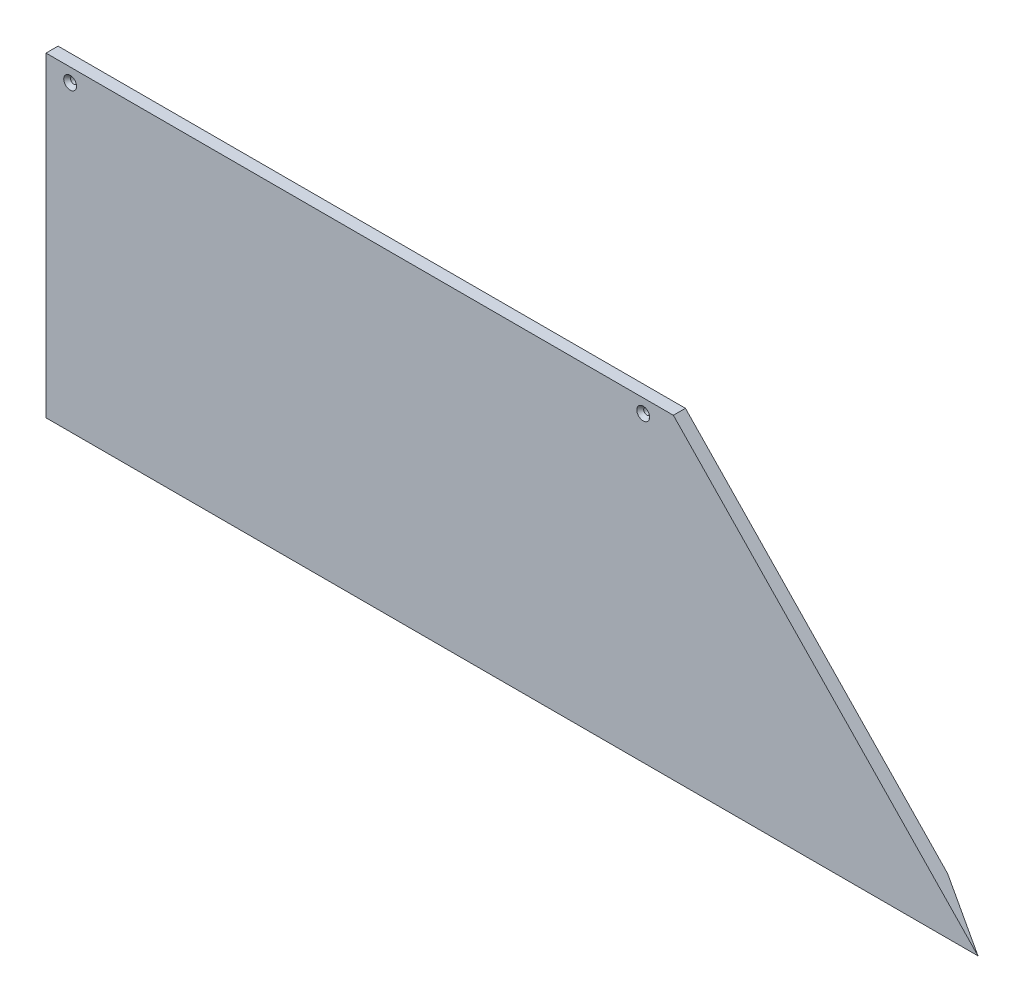
ISO-10303-21;
HEADER;
FILE_DESCRIPTION(('STEP AP214'),'2;1');
FILE_NAME('part.step','',(''),(''),'','','');
FILE_SCHEMA(('AUTOMOTIVE_DESIGN { 1 0 10303 214 1 1 1 1 }'));
ENDSEC;
DATA;
#1=APPLICATION_CONTEXT('core data for automotive mechanical design processes');
#2=APPLICATION_PROTOCOL_DEFINITION('international standard','automotive_design',2000,#1);
#3=PRODUCT_CONTEXT('',#1,'mechanical');
#4=PRODUCT('Part','Part','',(#3));
#5=PRODUCT_RELATED_PRODUCT_CATEGORY('part','',(#4));
#6=PRODUCT_DEFINITION_FORMATION('','',#4);
#7=PRODUCT_DEFINITION_CONTEXT('part definition',#1,'design');
#8=PRODUCT_DEFINITION('design','',#6,#7);
#9=PRODUCT_DEFINITION_SHAPE('','',#8);
#10=(LENGTH_UNIT() NAMED_UNIT(*) SI_UNIT(.MILLI.,.METRE.));
#11=(NAMED_UNIT(*) PLANE_ANGLE_UNIT() SI_UNIT($,.RADIAN.));
#12=(NAMED_UNIT(*) SI_UNIT($,.STERADIAN.) SOLID_ANGLE_UNIT());
#13=UNCERTAINTY_MEASURE_WITH_UNIT(LENGTH_MEASURE(1.E-05),#10,'distance_accuracy_value','');
#14=(GEOMETRIC_REPRESENTATION_CONTEXT(3) GLOBAL_UNCERTAINTY_ASSIGNED_CONTEXT((#13)) GLOBAL_UNIT_ASSIGNED_CONTEXT((#10,
#11,#12)) REPRESENTATION_CONTEXT('',''));
#15=CARTESIAN_POINT('',(0.,0.,0.));
#16=DIRECTION('',(0.,0.,1.));
#17=DIRECTION('',(1.,0.,0.));
#18=AXIS2_PLACEMENT_3D('',#15,#16,#17);
#19=CARTESIAN_POINT('',(820.588283229593,650.830336129829,0.));
#20=DIRECTION('',(0.,0.,1.));
#21=DIRECTION('',(-1.,0.,0.));
#22=AXIS2_PLACEMENT_3D('',#19,#20,#21);
#23=PLANE('',#22);
#24=CARTESIAN_POINT('',(1288.81854000227,297.590703897091,0.));
#25=DIRECTION('',(0.,0.,1.));
#26=DIRECTION('',(0.,-1.,0.));
#27=AXIS2_PLACEMENT_3D('',#24,#25,#26);
#28=CIRCLE('',#27,3.37820000000007);
#29=CARTESIAN_POINT('',(1288.81854000227,294.212503897091,0.));
#30=VERTEX_POINT('',#29);
#31=EDGE_CURVE('E52',#30,#30,#28,.F.);
#32=ORIENTED_EDGE('',*,*,#31,.F.);
#33=EDGE_LOOP('',(#32));
#34=FACE_BOUND('',#33,.T.);
#35=CARTESIAN_POINT('',(685.684270001134,297.590703897091,-1.11022302462516E-13));
#36=DIRECTION('',(0.,0.,1.));
#37=DIRECTION('',(0.,-1.,0.));
#38=AXIS2_PLACEMENT_3D('',#35,#36,#37);
#39=CIRCLE('',#38,3.3782000000001);
#40=CARTESIAN_POINT('',(685.684270001134,294.212503897091,-1.10834774691426E-13));
#41=VERTEX_POINT('',#40);
#42=EDGE_CURVE('E142',#41,#41,#39,.F.);
#43=ORIENTED_EDGE('',*,*,#42,.F.);
#44=EDGE_LOOP('',(#43));
#45=FACE_BOUND('',#44,.T.);
#46=DIRECTION('',(1.,0.,0.));
#47=VECTOR('',#46,1.);
#48=CARTESIAN_POINT('',(820.588283229593,25.6740325966926,0.));
#49=LINE('',#48,#47);
#50=CARTESIAN_POINT('',(660.284270001134,25.6740325966926,0.));
#51=VERTEX_POINT('',#50);
#52=CARTESIAN_POINT('',(1596.56270603019,25.6740325966926,0.));
#53=VERTEX_POINT('',#52);
#54=EDGE_CURVE('E69',#51,#53,#49,.T.);
#55=ORIENTED_EDGE('',*,*,#54,.F.);
#56=DIRECTION('',(0.,-1.,0.));
#57=VECTOR('',#56,1.);
#58=CARTESIAN_POINT('',(660.284270001134,145.643975389749,-1.38777878078145E-13));
#59=LINE('',#58,#57);
#60=CARTESIAN_POINT('',(660.284270001134,311.878203897091,-1.94289029309402E-13));
#61=VERTEX_POINT('',#60);
#62=EDGE_CURVE('E120',#61,#51,#59,.T.);
#63=ORIENTED_EDGE('',*,*,#62,.F.);
#64=DIRECTION('',(-1.,0.,0.));
#65=VECTOR('',#64,1.);
#66=CARTESIAN_POINT('',(990.4264050017,311.878203897091,-2.08166817117217E-13));
#67=LINE('',#66,#65);
#68=CARTESIAN_POINT('',(1320.56854000227,311.878203897091,-2.22044604925031E-13));
#69=VERTEX_POINT('',#68);
#70=EDGE_CURVE('E141',#69,#61,#67,.T.);
#71=ORIENTED_EDGE('',*,*,#70,.F.);
#72=DIRECTION('',(0.694150652110275,-0.719829752215674,0.));
#73=VECTOR('',#72,1.);
#74=CARTESIAN_POINT('',(1480.87255323073,145.643975389749,-2.1163626406917E-13));
#75=LINE('',#74,#73);
#76=EDGE_CURVE('E58',#69,#53,#75,.T.);
#77=ORIENTED_EDGE('',*,*,#76,.T.);
#78=EDGE_LOOP('',(#55,#63,#71,#77));
#79=FACE_BOUND('',#78,.T.);
#80=ADVANCED_FACE('F48',(#34,#45,#79),#23,.F.);
#81=CARTESIAN_POINT('',(660.284270001134,145.643975389749,12.7019999999998));
#82=DIRECTION('',(-1.,0.,0.));
#83=DIRECTION('',(0.,-0.26471698178117,-0.964326147917118));
#84=AXIS2_PLACEMENT_3D('',#81,#82,#83);
#85=PLANE('',#84);
#86=ORIENTED_EDGE('',*,*,#62,.T.);
#87=DIRECTION('',(0.,-0.964326147917118,0.26471698178117));
#88=VECTOR('',#87,1.);
#89=CARTESIAN_POINT('',(660.284270001134,133.994587907647,-29.7350543990856));
#90=LINE('',#89,#88);
#91=CARTESIAN_POINT('',(660.284270001134,-20.5902531175931,12.6999999999999));
#92=VERTEX_POINT('',#91);
#93=EDGE_CURVE('E108',#51,#92,#90,.T.);
#94=ORIENTED_EDGE('',*,*,#93,.T.);
#95=DIRECTION('',(0.,-1.,0.));
#96=VECTOR('',#95,1.);
#97=CARTESIAN_POINT('',(660.284270001134,145.643975389749,12.6999999999999));
#98=LINE('',#97,#96);
#99=CARTESIAN_POINT('',(660.284270001134,311.878203897091,12.6999999999999));
#100=VERTEX_POINT('',#99);
#101=EDGE_CURVE('E117',#100,#92,#98,.T.);
#102=ORIENTED_EDGE('',*,*,#101,.F.);
#103=DIRECTION('',(0.,0.,-1.));
#104=VECTOR('',#103,1.);
#105=CARTESIAN_POINT('',(660.284270001134,311.878203897091,12.7019999999998));
#106=LINE('',#105,#104);
#107=EDGE_CURVE('E81',#100,#61,#106,.T.);
#108=ORIENTED_EDGE('',*,*,#107,.T.);
#109=EDGE_LOOP('',(#86,#94,#102,#108));
#110=FACE_BOUND('',#109,.T.);
#111=ADVANCED_FACE('F116',(#110),#85,.T.);
#112=CARTESIAN_POINT('',(1480.87255323073,145.643975389749,12.7019999999998));
#113=DIRECTION('',(-0.719829752215675,-0.694150652110276,0.));
#114=DIRECTION('',(-0.680983159335232,0.706175147076652,-0.193852001158297));
#115=AXIS2_PLACEMENT_3D('',#112,#113,#114);
#116=PLANE('',#115);
#117=DIRECTION('',(0.680983159335232,-0.706175147076652,0.193852001158297));
#118=VECTOR('',#117,1.);
#119=CARTESIAN_POINT('',(1486.89681737812,139.396852297207,-31.2180289373962));
#120=LINE('',#119,#118);
#121=CARTESIAN_POINT('',(1641.17656645918,-20.590253117593,12.6999999999999));
#122=VERTEX_POINT('',#121);
#123=EDGE_CURVE('E11',#53,#122,#120,.T.);
#124=ORIENTED_EDGE('',*,*,#123,.F.);
#125=ORIENTED_EDGE('',*,*,#76,.F.);
#126=DIRECTION('',(0.,0.,-1.));
#127=VECTOR('',#126,1.);
#128=CARTESIAN_POINT('',(1320.56854000227,311.878203897091,12.7019999999998));
#129=LINE('',#128,#127);
#130=CARTESIAN_POINT('',(1320.56854000227,311.878203897091,12.6999999999998));
#131=VERTEX_POINT('',#130);
#132=EDGE_CURVE('E139',#131,#69,#129,.T.);
#133=ORIENTED_EDGE('',*,*,#132,.F.);
#134=DIRECTION('',(0.694150652110275,-0.719829752215674,0.));
#135=VECTOR('',#134,1.);
#136=CARTESIAN_POINT('',(1480.87255323073,145.643975389749,12.6999999999998));
#137=LINE('',#136,#135);
#138=EDGE_CURVE('E114',#131,#122,#137,.T.);
#139=ORIENTED_EDGE('',*,*,#138,.T.);
#140=EDGE_LOOP('',(#124,#125,#133,#139));
#141=FACE_BOUND('',#140,.T.);
#142=ADVANCED_FACE('F173',(#141),#116,.F.);
#143=CARTESIAN_POINT('',(-2.23913346286443E-13,315.240109565712,12.6999999999998));
#144=DIRECTION('',(0.,0.,1.));
#145=DIRECTION('',(1.,0.,0.));
#146=AXIS2_PLACEMENT_3D('',#143,#144,#145);
#147=PLANE('',#146);
#148=CARTESIAN_POINT('',(1288.81854000227,297.590703897091,12.6999999999999));
#149=DIRECTION('',(0.,0.,1.));
#150=DIRECTION('',(0.,-1.,0.));
#151=AXIS2_PLACEMENT_3D('',#148,#149,#150);
#152=CIRCLE('',#151,6.74370000000008);
#153=CARTESIAN_POINT('',(1288.81854000227,290.84700389709,12.6999999999999));
#154=VERTEX_POINT('',#153);
#155=EDGE_CURVE('E336',#154,#154,#152,.T.);
#156=ORIENTED_EDGE('',*,*,#155,.F.);
#157=EDGE_LOOP('',(#156));
#158=FACE_BOUND('',#157,.T.);
#159=CARTESIAN_POINT('',(685.684270001134,297.590703897091,12.6999999999998));
#160=DIRECTION('',(0.,0.,1.));
#161=DIRECTION('',(0.,-1.,0.));
#162=AXIS2_PLACEMENT_3D('',#159,#160,#161);
#163=CIRCLE('',#162,6.74370000000008);
#164=CARTESIAN_POINT('',(685.684270001134,290.847003897091,12.6999999999998));
#165=VERTEX_POINT('',#164);
#166=EDGE_CURVE('E153',#165,#165,#163,.T.);
#167=ORIENTED_EDGE('',*,*,#166,.F.);
#168=EDGE_LOOP('',(#167));
#169=FACE_BOUND('',#168,.T.);
#170=DIRECTION('',(-1.,0.,0.));
#171=VECTOR('',#170,1.);
#172=CARTESIAN_POINT('',(990.4264050017,311.878203897091,12.6999999999999));
#173=LINE('',#172,#171);
#174=EDGE_CURVE('E125',#131,#100,#173,.T.);
#175=ORIENTED_EDGE('',*,*,#174,.T.);
#176=ORIENTED_EDGE('',*,*,#101,.T.);
#177=DIRECTION('',(-1.,0.,0.));
#178=VECTOR('',#177,1.);
#179=CARTESIAN_POINT('',(1150.73041823016,-20.5902531175931,12.6999999999999));
#180=LINE('',#179,#178);
#181=EDGE_CURVE('E105',#122,#92,#180,.T.);
#182=ORIENTED_EDGE('',*,*,#181,.F.);
#183=ORIENTED_EDGE('',*,*,#138,.F.);
#184=EDGE_LOOP('',(#175,#176,#182,#183));
#185=FACE_BOUND('',#184,.T.);
#186=ADVANCED_FACE('F123',(#158,#169,#185),#147,.T.);
#187=CARTESIAN_POINT('',(990.4264050017,311.878203897091,12.7019999999998));
#188=DIRECTION('',(0.,1.,0.));
#189=DIRECTION('',(0.,0.,1.));
#190=AXIS2_PLACEMENT_3D('',#187,#188,#189);
#191=PLANE('',#190);
#192=ORIENTED_EDGE('',*,*,#132,.T.);
#193=ORIENTED_EDGE('',*,*,#70,.T.);
#194=ORIENTED_EDGE('',*,*,#107,.F.);
#195=ORIENTED_EDGE('',*,*,#174,.F.);
#196=EDGE_LOOP('',(#192,#193,#194,#195));
#197=FACE_BOUND('',#196,.T.);
#198=ADVANCED_FACE('F50',(#197),#191,.T.);
#199=CARTESIAN_POINT('',(2.13127923513117E-13,640.744619123967,-168.842906105527));
#200=DIRECTION('',(0.,-0.26471698178117,-0.964326147917118));
#201=DIRECTION('',(1.,0.,0.));
#202=AXIS2_PLACEMENT_3D('',#199,#200,#201);
#203=PLANE('',#202);
#204=ORIENTED_EDGE('',*,*,#54,.T.);
#205=ORIENTED_EDGE('',*,*,#123,.T.);
#206=ORIENTED_EDGE('',*,*,#181,.T.);
#207=ORIENTED_EDGE('',*,*,#93,.F.);
#208=EDGE_LOOP('',(#204,#205,#206,#207));
#209=FACE_BOUND('',#208,.T.);
#210=ADVANCED_FACE('F107',(#209),#203,.T.);
#211=CARTESIAN_POINT('',(685.684270001134,297.59070389709,-1678.87938114314));
#212=DIRECTION('',(0.,0.,1.));
#213=DIRECTION('',(0.,-1.,0.));
#214=AXIS2_PLACEMENT_3D('',#211,#212,#213);
#215=CYLINDRICAL_SURFACE('',#214,3.3782000000001);
#216=CARTESIAN_POINT('',(685.684270001134,297.590703897091,8.82843512549744));
#217=DIRECTION('',(0.,0.,1.));
#218=DIRECTION('',(0.,-1.,0.));
#219=AXIS2_PLACEMENT_3D('',#216,#217,#218);
#220=CIRCLE('',#219,3.3782);
#221=CARTESIAN_POINT('',(685.684270001134,294.212503897091,8.82843512549744));
#222=VERTEX_POINT('',#221);
#223=EDGE_CURVE('E145',#222,#222,#220,.T.);
#224=ORIENTED_EDGE('',*,*,#223,.T.);
#225=EDGE_LOOP('',(#224));
#226=FACE_BOUND('',#225,.T.);
#227=ORIENTED_EDGE('',*,*,#42,.T.);
#228=EDGE_LOOP('',(#227));
#229=FACE_BOUND('',#228,.T.);
#230=ADVANCED_FACE('F180',(#226,#229),#215,.F.);
#231=CARTESIAN_POINT('',(685.684270001134,297.590703897091,8.82843512549744));
#232=DIRECTION('',(0.,0.,1.));
#233=DIRECTION('',(0.,-1.,0.));
#234=AXIS2_PLACEMENT_3D('',#231,#232,#233);
#235=CONICAL_SURFACE('',#234,3.37820000000004,0.715584993317674);
#236=ORIENTED_EDGE('',*,*,#166,.T.);
#237=EDGE_LOOP('',(#236));
#238=FACE_BOUND('',#237,.T.);
#239=ORIENTED_EDGE('',*,*,#223,.F.);
#240=EDGE_LOOP('',(#239));
#241=FACE_BOUND('',#240,.T.);
#242=ADVANCED_FACE('F237',(#238,#241),#235,.F.);
#243=CARTESIAN_POINT('',(1288.81854000227,297.59070389709,-1678.87938114314));
#244=DIRECTION('',(0.,0.,1.));
#245=DIRECTION('',(0.,-1.,0.));
#246=AXIS2_PLACEMENT_3D('',#243,#244,#245);
#247=CYLINDRICAL_SURFACE('',#246,3.37820000000007);
#248=CARTESIAN_POINT('',(1288.81854000227,297.590703897091,8.82843512549693));
#249=DIRECTION('',(0.,0.,1.));
#250=DIRECTION('',(0.,-1.,0.));
#251=AXIS2_PLACEMENT_3D('',#248,#249,#250);
#252=CIRCLE('',#251,3.3782);
#253=CARTESIAN_POINT('',(1288.81854000227,294.212503897091,8.82843512549693));
#254=VERTEX_POINT('',#253);
#255=EDGE_CURVE('E282',#254,#254,#252,.T.);
#256=ORIENTED_EDGE('',*,*,#255,.T.);
#257=EDGE_LOOP('',(#256));
#258=FACE_BOUND('',#257,.T.);
#259=ORIENTED_EDGE('',*,*,#31,.T.);
#260=EDGE_LOOP('',(#259));
#261=FACE_BOUND('',#260,.T.);
#262=ADVANCED_FACE('F247',(#258,#261),#247,.F.);
#263=CARTESIAN_POINT('',(1288.81854000227,297.590703897091,8.82843512549693));
#264=DIRECTION('',(0.,0.,1.));
#265=DIRECTION('',(0.,-1.,0.));
#266=AXIS2_PLACEMENT_3D('',#263,#264,#265);
#267=CONICAL_SURFACE('',#266,3.3782,0.715584993317619);
#268=ORIENTED_EDGE('',*,*,#155,.T.);
#269=EDGE_LOOP('',(#268));
#270=FACE_BOUND('',#269,.T.);
#271=ORIENTED_EDGE('',*,*,#255,.F.);
#272=EDGE_LOOP('',(#271));
#273=FACE_BOUND('',#272,.T.);
#274=ADVANCED_FACE('F259',(#270,#273),#267,.F.);
#275=CLOSED_SHELL('',(#80,#111,#142,#186,#198,#210,#230,#242,#262,#274));
#276=MANIFOLD_SOLID_BREP('B2',#275);
#277=ADVANCED_BREP_SHAPE_REPRESENTATION('',(#18,#276),#14);
#278=SHAPE_DEFINITION_REPRESENTATION(#9,#277);
ENDSEC;
END-ISO-10303-21;
